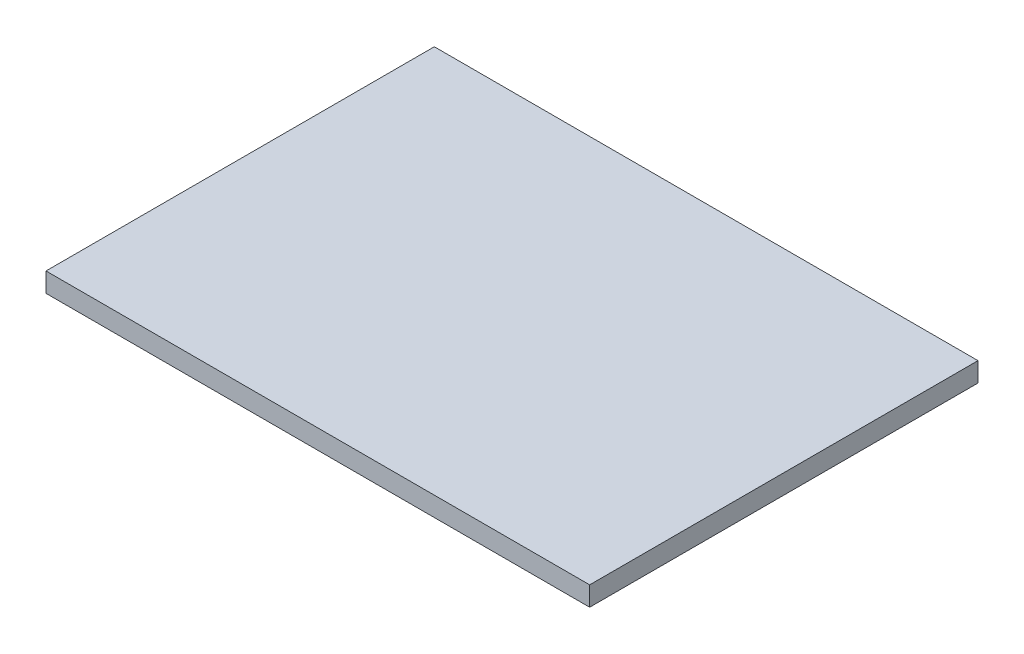
ISO-10303-21;
HEADER;
FILE_DESCRIPTION(('STEP AP214'),'2;1');
FILE_NAME('part.step','',(''),(''),'','','');
FILE_SCHEMA(('AUTOMOTIVE_DESIGN { 1 0 10303 214 1 1 1 1 }'));
ENDSEC;
DATA;
#1=APPLICATION_CONTEXT('core data for automotive mechanical design processes');
#2=APPLICATION_PROTOCOL_DEFINITION('international standard','automotive_design',2000,#1);
#3=PRODUCT_CONTEXT('',#1,'mechanical');
#4=PRODUCT('Part','Part','',(#3));
#5=PRODUCT_RELATED_PRODUCT_CATEGORY('part','',(#4));
#6=PRODUCT_DEFINITION_FORMATION('','',#4);
#7=PRODUCT_DEFINITION_CONTEXT('part definition',#1,'design');
#8=PRODUCT_DEFINITION('design','',#6,#7);
#9=PRODUCT_DEFINITION_SHAPE('','',#8);
#10=(LENGTH_UNIT() NAMED_UNIT(*) SI_UNIT(.MILLI.,.METRE.));
#11=(NAMED_UNIT(*) PLANE_ANGLE_UNIT() SI_UNIT($,.RADIAN.));
#12=(NAMED_UNIT(*) SI_UNIT($,.STERADIAN.) SOLID_ANGLE_UNIT());
#13=UNCERTAINTY_MEASURE_WITH_UNIT(LENGTH_MEASURE(1.E-05),#10,'distance_accuracy_value','');
#14=(GEOMETRIC_REPRESENTATION_CONTEXT(3) GLOBAL_UNCERTAINTY_ASSIGNED_CONTEXT((#13)) GLOBAL_UNIT_ASSIGNED_CONTEXT((#10,
#11,#12)) REPRESENTATION_CONTEXT('',''));
#15=CARTESIAN_POINT('',(0.,0.,0.));
#16=DIRECTION('',(0.,0.,1.));
#17=DIRECTION('',(1.,0.,0.));
#18=AXIS2_PLACEMENT_3D('',#15,#16,#17);
#19=CARTESIAN_POINT('',(-175.721572794899,25.4,-120.251859723698));
#20=DIRECTION('',(1.,0.,0.));
#21=DIRECTION('',(0.,0.,-1.));
#22=AXIS2_PLACEMENT_3D('',#19,#20,#21);
#23=PLANE('',#22);
#24=DIRECTION('',(0.,0.,1.));
#25=VECTOR('',#24,1.);
#26=CARTESIAN_POINT('',(-175.721572794899,0.,-120.251859723698));
#27=LINE('',#26,#25);
#28=CARTESIAN_POINT('',(-175.721572794899,0.,-120.251859723698));
#29=VERTEX_POINT('',#28);
#30=CARTESIAN_POINT('',(-175.721572794899,0.,387.748140276302));
#31=VERTEX_POINT('',#30);
#32=EDGE_CURVE('E97',#29,#31,#27,.T.);
#33=ORIENTED_EDGE('',*,*,#32,.T.);
#34=DIRECTION('',(0.,-1.,0.));
#35=VECTOR('',#34,1.);
#36=CARTESIAN_POINT('',(-175.721572794899,25.4,387.748140276302));
#37=LINE('',#36,#35);
#38=CARTESIAN_POINT('',(-175.721572794899,25.4,387.748140276302));
#39=VERTEX_POINT('',#38);
#40=EDGE_CURVE('E11',#39,#31,#37,.T.);
#41=ORIENTED_EDGE('',*,*,#40,.F.);
#42=DIRECTION('',(0.,0.,1.));
#43=VECTOR('',#42,1.);
#44=CARTESIAN_POINT('',(-175.721572794899,25.4,-120.251859723698));
#45=LINE('',#44,#43);
#46=CARTESIAN_POINT('',(-175.721572794899,25.4,-120.251859723698));
#47=VERTEX_POINT('',#46);
#48=EDGE_CURVE('E85',#47,#39,#45,.T.);
#49=ORIENTED_EDGE('',*,*,#48,.F.);
#50=DIRECTION('',(0.,-1.,0.));
#51=VECTOR('',#50,1.);
#52=CARTESIAN_POINT('',(-175.721572794899,25.4,-120.251859723698));
#53=LINE('',#52,#51);
#54=EDGE_CURVE('E93',#47,#29,#53,.T.);
#55=ORIENTED_EDGE('',*,*,#54,.T.);
#56=EDGE_LOOP('',(#33,#41,#49,#55));
#57=FACE_BOUND('',#56,.T.);
#58=ADVANCED_FACE('F34',(#57),#23,.F.);
#59=CARTESIAN_POINT('',(-175.721572794899,25.4,387.748140276302));
#60=DIRECTION('',(0.,0.,-1.));
#61=DIRECTION('',(-1.,0.,0.));
#62=AXIS2_PLACEMENT_3D('',#59,#60,#61);
#63=PLANE('',#62);
#64=DIRECTION('',(1.,0.,0.));
#65=VECTOR('',#64,1.);
#66=CARTESIAN_POINT('',(-175.721572794899,0.,387.748140276302));
#67=LINE('',#66,#65);
#68=CARTESIAN_POINT('',(535.478427205101,0.,387.748140276302));
#69=VERTEX_POINT('',#68);
#70=EDGE_CURVE('E89',#31,#69,#67,.T.);
#71=ORIENTED_EDGE('',*,*,#70,.T.);
#72=DIRECTION('',(0.,-1.,0.));
#73=VECTOR('',#72,1.);
#74=CARTESIAN_POINT('',(535.478427205101,25.4,387.748140276302));
#75=LINE('',#74,#73);
#76=CARTESIAN_POINT('',(535.478427205101,25.4,387.748140276302));
#77=VERTEX_POINT('',#76);
#78=EDGE_CURVE('E42',#77,#69,#75,.T.);
#79=ORIENTED_EDGE('',*,*,#78,.F.);
#80=DIRECTION('',(1.,0.,0.));
#81=VECTOR('',#80,1.);
#82=CARTESIAN_POINT('',(-175.721572794899,25.4,387.748140276302));
#83=LINE('',#82,#81);
#84=EDGE_CURVE('E80',#39,#77,#83,.T.);
#85=ORIENTED_EDGE('',*,*,#84,.F.);
#86=ORIENTED_EDGE('',*,*,#40,.T.);
#87=EDGE_LOOP('',(#71,#79,#85,#86));
#88=FACE_BOUND('',#87,.T.);
#89=ADVANCED_FACE('F88',(#88),#63,.F.);
#90=CARTESIAN_POINT('',(535.478427205101,25.4,-120.251859723698));
#91=DIRECTION('',(-1.,0.,0.));
#92=DIRECTION('',(0.,0.,1.));
#93=AXIS2_PLACEMENT_3D('',#90,#91,#92);
#94=PLANE('',#93);
#95=DIRECTION('',(0.,0.,-1.));
#96=VECTOR('',#95,1.);
#97=CARTESIAN_POINT('',(535.478427205101,0.,-120.251859723698));
#98=LINE('',#97,#96);
#99=CARTESIAN_POINT('',(535.478427205101,0.,-120.251859723698));
#100=VERTEX_POINT('',#99);
#101=EDGE_CURVE('E67',#69,#100,#98,.T.);
#102=ORIENTED_EDGE('',*,*,#101,.T.);
#103=DIRECTION('',(0.,-1.,0.));
#104=VECTOR('',#103,1.);
#105=CARTESIAN_POINT('',(535.478427205101,25.4,-120.251859723698));
#106=LINE('',#105,#104);
#107=CARTESIAN_POINT('',(535.478427205101,25.4,-120.251859723698));
#108=VERTEX_POINT('',#107);
#109=EDGE_CURVE('E90',#108,#100,#106,.T.);
#110=ORIENTED_EDGE('',*,*,#109,.F.);
#111=DIRECTION('',(0.,0.,-1.));
#112=VECTOR('',#111,1.);
#113=CARTESIAN_POINT('',(535.478427205101,25.4,-120.251859723698));
#114=LINE('',#113,#112);
#115=EDGE_CURVE('E83',#77,#108,#114,.T.);
#116=ORIENTED_EDGE('',*,*,#115,.F.);
#117=ORIENTED_EDGE('',*,*,#78,.T.);
#118=EDGE_LOOP('',(#102,#110,#116,#117));
#119=FACE_BOUND('',#118,.T.);
#120=ADVANCED_FACE('F91',(#119),#94,.F.);
#121=CARTESIAN_POINT('',(-175.721572794899,25.4,-120.251859723698));
#122=DIRECTION('',(0.,0.,1.));
#123=DIRECTION('',(1.,0.,0.));
#124=AXIS2_PLACEMENT_3D('',#121,#122,#123);
#125=PLANE('',#124);
#126=DIRECTION('',(-1.,0.,0.));
#127=VECTOR('',#126,1.);
#128=CARTESIAN_POINT('',(-175.721572794899,0.,-120.251859723698));
#129=LINE('',#128,#127);
#130=EDGE_CURVE('E73',#100,#29,#129,.T.);
#131=ORIENTED_EDGE('',*,*,#130,.T.);
#132=ORIENTED_EDGE('',*,*,#54,.F.);
#133=DIRECTION('',(-1.,0.,0.));
#134=VECTOR('',#133,1.);
#135=CARTESIAN_POINT('',(-175.721572794899,25.4,-120.251859723698));
#136=LINE('',#135,#134);
#137=EDGE_CURVE('E50',#108,#47,#136,.T.);
#138=ORIENTED_EDGE('',*,*,#137,.F.);
#139=ORIENTED_EDGE('',*,*,#109,.T.);
#140=EDGE_LOOP('',(#131,#132,#138,#139));
#141=FACE_BOUND('',#140,.T.);
#142=ADVANCED_FACE('F104',(#141),#125,.F.);
#143=CARTESIAN_POINT('',(0.,25.4,0.));
#144=DIRECTION('',(0.,1.,0.));
#145=DIRECTION('',(0.,0.,1.));
#146=AXIS2_PLACEMENT_3D('',#143,#144,#145);
#147=PLANE('',#146);
#148=ORIENTED_EDGE('',*,*,#48,.T.);
#149=ORIENTED_EDGE('',*,*,#84,.T.);
#150=ORIENTED_EDGE('',*,*,#115,.T.);
#151=ORIENTED_EDGE('',*,*,#137,.T.);
#152=EDGE_LOOP('',(#148,#149,#150,#151));
#153=FACE_BOUND('',#152,.T.);
#154=ADVANCED_FACE('F81',(#153),#147,.T.);
#155=CARTESIAN_POINT('',(0.,0.,0.));
#156=DIRECTION('',(0.,1.,0.));
#157=DIRECTION('',(0.,0.,1.));
#158=AXIS2_PLACEMENT_3D('',#155,#156,#157);
#159=PLANE('',#158);
#160=ORIENTED_EDGE('',*,*,#32,.F.);
#161=ORIENTED_EDGE('',*,*,#130,.F.);
#162=ORIENTED_EDGE('',*,*,#101,.F.);
#163=ORIENTED_EDGE('',*,*,#70,.F.);
#164=EDGE_LOOP('',(#160,#161,#162,#163));
#165=FACE_BOUND('',#164,.T.);
#166=ADVANCED_FACE('F107',(#165),#159,.F.);
#167=CLOSED_SHELL('',(#58,#89,#120,#142,#154,#166));
#168=MANIFOLD_SOLID_BREP('B2',#167);
#169=ADVANCED_BREP_SHAPE_REPRESENTATION('',(#18,#168),#14);
#170=SHAPE_DEFINITION_REPRESENTATION(#9,#169);
ENDSEC;
END-ISO-10303-21;
